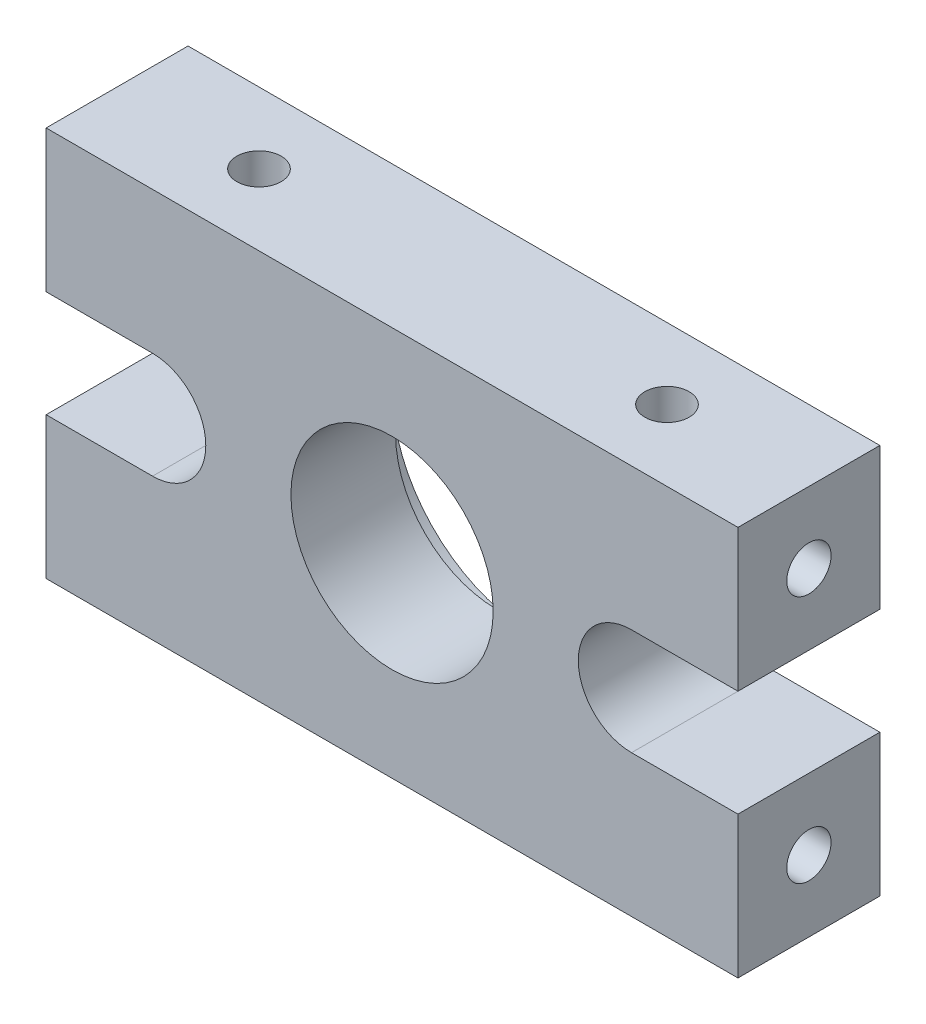
ISO-10303-21;
HEADER;
FILE_DESCRIPTION(('STEP AP214'),'2;1');
FILE_NAME('part.step','',(''),(''),'','','');
FILE_SCHEMA(('AUTOMOTIVE_DESIGN { 1 0 10303 214 1 1 1 1 }'));
ENDSEC;
DATA;
#1=APPLICATION_CONTEXT('core data for automotive mechanical design processes');
#2=APPLICATION_PROTOCOL_DEFINITION('international standard','automotive_design',2000,#1);
#3=PRODUCT_CONTEXT('',#1,'mechanical');
#4=PRODUCT('Part','Part','',(#3));
#5=PRODUCT_RELATED_PRODUCT_CATEGORY('part','',(#4));
#6=PRODUCT_DEFINITION_FORMATION('','',#4);
#7=PRODUCT_DEFINITION_CONTEXT('part definition',#1,'design');
#8=PRODUCT_DEFINITION('design','',#6,#7);
#9=PRODUCT_DEFINITION_SHAPE('','',#8);
#10=(LENGTH_UNIT() NAMED_UNIT(*) SI_UNIT(.MILLI.,.METRE.));
#11=(NAMED_UNIT(*) PLANE_ANGLE_UNIT() SI_UNIT($,.RADIAN.));
#12=(NAMED_UNIT(*) SI_UNIT($,.STERADIAN.) SOLID_ANGLE_UNIT());
#13=UNCERTAINTY_MEASURE_WITH_UNIT(LENGTH_MEASURE(1.E-05),#10,'distance_accuracy_value','');
#14=(GEOMETRIC_REPRESENTATION_CONTEXT(3) GLOBAL_UNCERTAINTY_ASSIGNED_CONTEXT((#13)) GLOBAL_UNIT_ASSIGNED_CONTEXT((#10,
#11,#12)) REPRESENTATION_CONTEXT('',''));
#15=CARTESIAN_POINT('',(0.,0.,0.));
#16=DIRECTION('',(0.,0.,1.));
#17=DIRECTION('',(1.,0.,0.));
#18=AXIS2_PLACEMENT_3D('',#15,#16,#17);
#19=CARTESIAN_POINT('',(19.5,11.,8.));
#20=DIRECTION('',(0.,0.,-1.));
#21=DIRECTION('',(-1.,0.,0.));
#22=AXIS2_PLACEMENT_3D('',#19,#20,#21);
#23=CYLINDRICAL_SURFACE('',#22,5.70000000000001);
#24=CARTESIAN_POINT('',(19.5,11.,8.));
#25=DIRECTION('',(0.,0.,1.));
#26=DIRECTION('',(1.,0.,0.));
#27=AXIS2_PLACEMENT_3D('',#24,#25,#26);
#28=CIRCLE('',#27,5.70000000000001);
#29=CARTESIAN_POINT('',(25.2,11.,8.));
#30=VERTEX_POINT('',#29);
#31=EDGE_CURVE('E165',#30,#30,#28,.T.);
#32=ORIENTED_EDGE('',*,*,#31,.T.);
#33=EDGE_LOOP('',(#32));
#34=FACE_BOUND('',#33,.T.);
#35=CARTESIAN_POINT('',(19.5,11.,2.1));
#36=DIRECTION('',(0.,0.,-1.));
#37=DIRECTION('',(-1.,0.,0.));
#38=AXIS2_PLACEMENT_3D('',#35,#36,#37);
#39=CIRCLE('',#38,5.70000000000001);
#40=CARTESIAN_POINT('',(13.8,11.,2.1));
#41=VERTEX_POINT('',#40);
#42=EDGE_CURVE('E39',#41,#41,#39,.T.);
#43=ORIENTED_EDGE('',*,*,#42,.T.);
#44=EDGE_LOOP('',(#43));
#45=FACE_BOUND('',#44,.T.);
#46=ADVANCED_FACE('F35',(#34,#45),#23,.F.);
#47=CARTESIAN_POINT('',(33.,11.,8.));
#48=DIRECTION('',(0.,0.,-1.));
#49=DIRECTION('',(-1.,0.,0.));
#50=AXIS2_PLACEMENT_3D('',#47,#48,#49);
#51=PLANE('',#50);
#52=DIRECTION('',(0.,-1.,0.));
#53=VECTOR('',#52,1.);
#54=CARTESIAN_POINT('',(0.,8.,8.));
#55=LINE('',#54,#53);
#56=CARTESIAN_POINT('',(0.,8.,8.));
#57=VERTEX_POINT('',#56);
#58=CARTESIAN_POINT('',(0.,0.,8.));
#59=VERTEX_POINT('',#58);
#60=EDGE_CURVE('E184',#57,#59,#55,.T.);
#61=ORIENTED_EDGE('',*,*,#60,.T.);
#62=DIRECTION('',(1.,0.,0.));
#63=VECTOR('',#62,1.);
#64=CARTESIAN_POINT('',(0.,0.,8.));
#65=LINE('',#64,#63);
#66=CARTESIAN_POINT('',(39.,0.,8.));
#67=VERTEX_POINT('',#66);
#68=EDGE_CURVE('E109',#59,#67,#65,.T.);
#69=ORIENTED_EDGE('',*,*,#68,.T.);
#70=DIRECTION('',(0.,1.,0.));
#71=VECTOR('',#70,1.);
#72=CARTESIAN_POINT('',(39.,0.,8.));
#73=LINE('',#72,#71);
#74=CARTESIAN_POINT('',(39.,8.,8.));
#75=VERTEX_POINT('',#74);
#76=EDGE_CURVE('E212',#67,#75,#73,.T.);
#77=ORIENTED_EDGE('',*,*,#76,.T.);
#78=DIRECTION('',(-1.,0.,0.));
#79=VECTOR('',#78,1.);
#80=CARTESIAN_POINT('',(39.,8.,8.));
#81=LINE('',#80,#79);
#82=CARTESIAN_POINT('',(33.,8.,8.));
#83=VERTEX_POINT('',#82);
#84=EDGE_CURVE('E230',#75,#83,#81,.T.);
#85=ORIENTED_EDGE('',*,*,#84,.T.);
#86=CARTESIAN_POINT('',(33.,11.,8.));
#87=DIRECTION('',(0.,0.,-1.));
#88=DIRECTION('',(-1.,0.,0.));
#89=AXIS2_PLACEMENT_3D('',#86,#87,#88);
#90=CIRCLE('',#89,3.);
#91=CARTESIAN_POINT('',(33.,14.,8.));
#92=VERTEX_POINT('',#91);
#93=EDGE_CURVE('E227',#83,#92,#90,.T.);
#94=ORIENTED_EDGE('',*,*,#93,.T.);
#95=DIRECTION('',(1.,0.,0.));
#96=VECTOR('',#95,1.);
#97=CARTESIAN_POINT('',(33.,14.,8.));
#98=LINE('',#97,#96);
#99=CARTESIAN_POINT('',(39.,14.,8.));
#100=VERTEX_POINT('',#99);
#101=EDGE_CURVE('E229',#92,#100,#98,.T.);
#102=ORIENTED_EDGE('',*,*,#101,.T.);
#103=DIRECTION('',(0.,1.,0.));
#104=VECTOR('',#103,1.);
#105=CARTESIAN_POINT('',(39.,14.,8.));
#106=LINE('',#105,#104);
#107=CARTESIAN_POINT('',(39.,22.,8.));
#108=VERTEX_POINT('',#107);
#109=EDGE_CURVE('E232',#100,#108,#106,.T.);
#110=ORIENTED_EDGE('',*,*,#109,.T.);
#111=DIRECTION('',(-1.,0.,0.));
#112=VECTOR('',#111,1.);
#113=CARTESIAN_POINT('',(39.,22.,8.));
#114=LINE('',#113,#112);
#115=CARTESIAN_POINT('',(0.,22.,8.));
#116=VERTEX_POINT('',#115);
#117=EDGE_CURVE('E238',#108,#116,#114,.T.);
#118=ORIENTED_EDGE('',*,*,#117,.T.);
#119=DIRECTION('',(0.,-1.,0.));
#120=VECTOR('',#119,1.);
#121=CARTESIAN_POINT('',(0.,14.,8.));
#122=LINE('',#121,#120);
#123=CARTESIAN_POINT('',(0.,14.,8.));
#124=VERTEX_POINT('',#123);
#125=EDGE_CURVE('E143',#116,#124,#122,.T.);
#126=ORIENTED_EDGE('',*,*,#125,.T.);
#127=DIRECTION('',(1.,0.,0.));
#128=VECTOR('',#127,1.);
#129=CARTESIAN_POINT('',(6.,14.,8.));
#130=LINE('',#129,#128);
#131=CARTESIAN_POINT('',(6.,14.,8.));
#132=VERTEX_POINT('',#131);
#133=EDGE_CURVE('E136',#124,#132,#130,.T.);
#134=ORIENTED_EDGE('',*,*,#133,.T.);
#135=CARTESIAN_POINT('',(6.,11.,8.));
#136=DIRECTION('',(0.,0.,-1.));
#137=DIRECTION('',(1.,0.,0.));
#138=AXIS2_PLACEMENT_3D('',#135,#136,#137);
#139=CIRCLE('',#138,3.);
#140=CARTESIAN_POINT('',(6.,8.,8.));
#141=VERTEX_POINT('',#140);
#142=EDGE_CURVE('E141',#132,#141,#139,.T.);
#143=ORIENTED_EDGE('',*,*,#142,.T.);
#144=DIRECTION('',(-1.,0.,0.));
#145=VECTOR('',#144,1.);
#146=CARTESIAN_POINT('',(0.,8.,8.));
#147=LINE('',#146,#145);
#148=EDGE_CURVE('E53',#141,#57,#147,.T.);
#149=ORIENTED_EDGE('',*,*,#148,.T.);
#150=EDGE_LOOP('',(#61,#69,#77,#85,#94,#102,#110,#118,#126,#134,#143,#149));
#151=FACE_BOUND('',#150,.T.);
#152=ORIENTED_EDGE('',*,*,#31,.F.);
#153=EDGE_LOOP('',(#152));
#154=FACE_BOUND('',#153,.T.);
#155=ADVANCED_FACE('F138',(#151,#154),#51,.F.);
#156=CARTESIAN_POINT('',(33.,11.,0.));
#157=DIRECTION('',(0.,0.,-1.));
#158=DIRECTION('',(-1.,0.,0.));
#159=AXIS2_PLACEMENT_3D('',#156,#157,#158);
#160=PLANE('',#159);
#161=CARTESIAN_POINT('',(19.5,11.,0.));
#162=DIRECTION('',(0.,0.,-1.));
#163=DIRECTION('',(-1.,0.,0.));
#164=AXIS2_PLACEMENT_3D('',#161,#162,#163);
#165=CIRCLE('',#164,8.);
#166=CARTESIAN_POINT('',(11.5,11.,0.));
#167=VERTEX_POINT('',#166);
#168=EDGE_CURVE('E284',#167,#167,#165,.T.);
#169=ORIENTED_EDGE('',*,*,#168,.F.);
#170=EDGE_LOOP('',(#169));
#171=FACE_BOUND('',#170,.T.);
#172=DIRECTION('',(0.,-1.,0.));
#173=VECTOR('',#172,1.);
#174=CARTESIAN_POINT('',(0.,8.,0.));
#175=LINE('',#174,#173);
#176=CARTESIAN_POINT('',(0.,8.,0.));
#177=VERTEX_POINT('',#176);
#178=CARTESIAN_POINT('',(0.,0.,0.));
#179=VERTEX_POINT('',#178);
#180=EDGE_CURVE('E161',#177,#179,#175,.T.);
#181=ORIENTED_EDGE('',*,*,#180,.F.);
#182=DIRECTION('',(-1.,0.,0.));
#183=VECTOR('',#182,1.);
#184=CARTESIAN_POINT('',(0.,8.,0.));
#185=LINE('',#184,#183);
#186=CARTESIAN_POINT('',(6.,8.,0.));
#187=VERTEX_POINT('',#186);
#188=EDGE_CURVE('E101',#187,#177,#185,.T.);
#189=ORIENTED_EDGE('',*,*,#188,.F.);
#190=CARTESIAN_POINT('',(6.,11.,0.));
#191=DIRECTION('',(0.,0.,-1.));
#192=DIRECTION('',(1.,0.,0.));
#193=AXIS2_PLACEMENT_3D('',#190,#191,#192);
#194=CIRCLE('',#193,3.);
#195=CARTESIAN_POINT('',(6.,14.,0.));
#196=VERTEX_POINT('',#195);
#197=EDGE_CURVE('E95',#196,#187,#194,.T.);
#198=ORIENTED_EDGE('',*,*,#197,.F.);
#199=DIRECTION('',(1.,0.,0.));
#200=VECTOR('',#199,1.);
#201=CARTESIAN_POINT('',(6.,14.,0.));
#202=LINE('',#201,#200);
#203=CARTESIAN_POINT('',(0.,14.,0.));
#204=VERTEX_POINT('',#203);
#205=EDGE_CURVE('E151',#204,#196,#202,.T.);
#206=ORIENTED_EDGE('',*,*,#205,.F.);
#207=DIRECTION('',(0.,-1.,0.));
#208=VECTOR('',#207,1.);
#209=CARTESIAN_POINT('',(0.,14.,0.));
#210=LINE('',#209,#208);
#211=CARTESIAN_POINT('',(0.,22.,0.));
#212=VERTEX_POINT('',#211);
#213=EDGE_CURVE('E179',#212,#204,#210,.T.);
#214=ORIENTED_EDGE('',*,*,#213,.F.);
#215=DIRECTION('',(-1.,0.,0.));
#216=VECTOR('',#215,1.);
#217=CARTESIAN_POINT('',(39.,22.,0.));
#218=LINE('',#217,#216);
#219=CARTESIAN_POINT('',(39.,22.,0.));
#220=VERTEX_POINT('',#219);
#221=EDGE_CURVE('E177',#220,#212,#218,.T.);
#222=ORIENTED_EDGE('',*,*,#221,.F.);
#223=DIRECTION('',(0.,1.,0.));
#224=VECTOR('',#223,1.);
#225=CARTESIAN_POINT('',(39.,14.,0.));
#226=LINE('',#225,#224);
#227=CARTESIAN_POINT('',(39.,14.,0.));
#228=VERTEX_POINT('',#227);
#229=EDGE_CURVE('E175',#228,#220,#226,.T.);
#230=ORIENTED_EDGE('',*,*,#229,.F.);
#231=DIRECTION('',(1.,0.,0.));
#232=VECTOR('',#231,1.);
#233=CARTESIAN_POINT('',(33.,14.,0.));
#234=LINE('',#233,#232);
#235=CARTESIAN_POINT('',(33.,14.,0.));
#236=VERTEX_POINT('',#235);
#237=EDGE_CURVE('E173',#236,#228,#234,.T.);
#238=ORIENTED_EDGE('',*,*,#237,.F.);
#239=CARTESIAN_POINT('',(33.,11.,0.));
#240=DIRECTION('',(0.,0.,-1.));
#241=DIRECTION('',(-1.,0.,0.));
#242=AXIS2_PLACEMENT_3D('',#239,#240,#241);
#243=CIRCLE('',#242,3.);
#244=CARTESIAN_POINT('',(33.,8.,0.));
#245=VERTEX_POINT('',#244);
#246=EDGE_CURVE('E171',#245,#236,#243,.T.);
#247=ORIENTED_EDGE('',*,*,#246,.F.);
#248=DIRECTION('',(-1.,0.,0.));
#249=VECTOR('',#248,1.);
#250=CARTESIAN_POINT('',(39.,8.,0.));
#251=LINE('',#250,#249);
#252=CARTESIAN_POINT('',(39.,8.,0.));
#253=VERTEX_POINT('',#252);
#254=EDGE_CURVE('E169',#253,#245,#251,.T.);
#255=ORIENTED_EDGE('',*,*,#254,.F.);
#256=DIRECTION('',(0.,1.,0.));
#257=VECTOR('',#256,1.);
#258=CARTESIAN_POINT('',(39.,0.,0.));
#259=LINE('',#258,#257);
#260=CARTESIAN_POINT('',(39.,0.,0.));
#261=VERTEX_POINT('',#260);
#262=EDGE_CURVE('E167',#261,#253,#259,.T.);
#263=ORIENTED_EDGE('',*,*,#262,.F.);
#264=DIRECTION('',(1.,0.,0.));
#265=VECTOR('',#264,1.);
#266=CARTESIAN_POINT('',(0.,0.,0.));
#267=LINE('',#266,#265);
#268=EDGE_CURVE('E164',#179,#261,#267,.T.);
#269=ORIENTED_EDGE('',*,*,#268,.F.);
#270=EDGE_LOOP('',(#181,#189,#198,#206,#214,#222,#230,#238,#247,#255,#263,#269));
#271=FACE_BOUND('',#270,.T.);
#272=ADVANCED_FACE('F216',(#171,#271),#160,.T.);
#273=CARTESIAN_POINT('',(0.,8.,8.));
#274=DIRECTION('',(1.,0.,0.));
#275=DIRECTION('',(0.,0.,-1.));
#276=AXIS2_PLACEMENT_3D('',#273,#274,#275);
#277=PLANE('',#276);
#278=CARTESIAN_POINT('',(0.,4.,4.));
#279=DIRECTION('',(-1.,0.,0.));
#280=DIRECTION('',(0.,0.,1.));
#281=AXIS2_PLACEMENT_3D('',#278,#279,#280);
#282=CIRCLE('',#281,1.24999999999999);
#283=CARTESIAN_POINT('',(0.,4.,5.24999999999999));
#284=VERTEX_POINT('',#283);
#285=EDGE_CURVE('E303',#284,#284,#282,.T.);
#286=ORIENTED_EDGE('',*,*,#285,.F.);
#287=EDGE_LOOP('',(#286));
#288=FACE_BOUND('',#287,.T.);
#289=ORIENTED_EDGE('',*,*,#180,.T.);
#290=DIRECTION('',(0.,0.,-1.));
#291=VECTOR('',#290,1.);
#292=CARTESIAN_POINT('',(0.,0.,8.));
#293=LINE('',#292,#291);
#294=EDGE_CURVE('E11',#59,#179,#293,.T.);
#295=ORIENTED_EDGE('',*,*,#294,.F.);
#296=ORIENTED_EDGE('',*,*,#60,.F.);
#297=DIRECTION('',(0.,0.,-1.));
#298=VECTOR('',#297,1.);
#299=CARTESIAN_POINT('',(0.,8.,8.));
#300=LINE('',#299,#298);
#301=EDGE_CURVE('E157',#57,#177,#300,.T.);
#302=ORIENTED_EDGE('',*,*,#301,.T.);
#303=EDGE_LOOP('',(#289,#295,#296,#302));
#304=FACE_BOUND('',#303,.T.);
#305=ADVANCED_FACE('F37',(#288,#304),#277,.F.);
#306=CARTESIAN_POINT('',(0.,0.,8.));
#307=DIRECTION('',(0.,1.,0.));
#308=DIRECTION('',(0.,0.,1.));
#309=AXIS2_PLACEMENT_3D('',#306,#307,#308);
#310=PLANE('',#309);
#311=ORIENTED_EDGE('',*,*,#268,.T.);
#312=DIRECTION('',(0.,0.,-1.));
#313=VECTOR('',#312,1.);
#314=CARTESIAN_POINT('',(39.,0.,8.));
#315=LINE('',#314,#313);
#316=EDGE_CURVE('E45',#67,#261,#315,.T.);
#317=ORIENTED_EDGE('',*,*,#316,.F.);
#318=ORIENTED_EDGE('',*,*,#68,.F.);
#319=ORIENTED_EDGE('',*,*,#294,.T.);
#320=EDGE_LOOP('',(#311,#317,#318,#319));
#321=FACE_BOUND('',#320,.T.);
#322=ADVANCED_FACE('F280',(#321),#310,.F.);
#323=CARTESIAN_POINT('',(39.,0.,8.));
#324=DIRECTION('',(-1.,0.,0.));
#325=DIRECTION('',(0.,0.,1.));
#326=AXIS2_PLACEMENT_3D('',#323,#324,#325);
#327=PLANE('',#326);
#328=CARTESIAN_POINT('',(39.,4.,4.));
#329=DIRECTION('',(1.,0.,0.));
#330=DIRECTION('',(0.,0.,-1.));
#331=AXIS2_PLACEMENT_3D('',#328,#329,#330);
#332=CIRCLE('',#331,1.24999999999999);
#333=CARTESIAN_POINT('',(39.,4.,2.75000000000001));
#334=VERTEX_POINT('',#333);
#335=EDGE_CURVE('E321',#334,#334,#332,.T.);
#336=ORIENTED_EDGE('',*,*,#335,.F.);
#337=EDGE_LOOP('',(#336));
#338=FACE_BOUND('',#337,.T.);
#339=ORIENTED_EDGE('',*,*,#262,.T.);
#340=DIRECTION('',(0.,0.,-1.));
#341=VECTOR('',#340,1.);
#342=CARTESIAN_POINT('',(39.,8.,8.));
#343=LINE('',#342,#341);
#344=EDGE_CURVE('E203',#75,#253,#343,.T.);
#345=ORIENTED_EDGE('',*,*,#344,.F.);
#346=ORIENTED_EDGE('',*,*,#76,.F.);
#347=ORIENTED_EDGE('',*,*,#316,.T.);
#348=EDGE_LOOP('',(#339,#345,#346,#347));
#349=FACE_BOUND('',#348,.T.);
#350=ADVANCED_FACE('F210',(#338,#349),#327,.F.);
#351=CARTESIAN_POINT('',(39.,8.,8.));
#352=DIRECTION('',(0.,-1.,0.));
#353=DIRECTION('',(1.,0.,0.));
#354=AXIS2_PLACEMENT_3D('',#351,#352,#353);
#355=PLANE('',#354);
#356=ORIENTED_EDGE('',*,*,#254,.T.);
#357=DIRECTION('',(0.,0.,-1.));
#358=VECTOR('',#357,1.);
#359=CARTESIAN_POINT('',(33.,8.,8.));
#360=LINE('',#359,#358);
#361=EDGE_CURVE('E200',#83,#245,#360,.T.);
#362=ORIENTED_EDGE('',*,*,#361,.F.);
#363=ORIENTED_EDGE('',*,*,#84,.F.);
#364=ORIENTED_EDGE('',*,*,#344,.T.);
#365=EDGE_LOOP('',(#356,#362,#363,#364));
#366=FACE_BOUND('',#365,.T.);
#367=ADVANCED_FACE('F221',(#366),#355,.F.);
#368=CARTESIAN_POINT('',(33.,11.,8.));
#369=DIRECTION('',(0.,0.,-1.));
#370=DIRECTION('',(-1.,0.,0.));
#371=AXIS2_PLACEMENT_3D('',#368,#369,#370);
#372=CYLINDRICAL_SURFACE('',#371,3.);
#373=ORIENTED_EDGE('',*,*,#246,.T.);
#374=DIRECTION('',(0.,0.,-1.));
#375=VECTOR('',#374,1.);
#376=CARTESIAN_POINT('',(33.,14.,8.));
#377=LINE('',#376,#375);
#378=EDGE_CURVE('E197',#92,#236,#377,.T.);
#379=ORIENTED_EDGE('',*,*,#378,.F.);
#380=ORIENTED_EDGE('',*,*,#93,.F.);
#381=ORIENTED_EDGE('',*,*,#361,.T.);
#382=EDGE_LOOP('',(#373,#379,#380,#381));
#383=FACE_BOUND('',#382,.T.);
#384=ADVANCED_FACE('F225',(#383),#372,.F.);
#385=CARTESIAN_POINT('',(33.,14.,8.));
#386=DIRECTION('',(0.,1.,0.));
#387=DIRECTION('',(0.,0.,1.));
#388=AXIS2_PLACEMENT_3D('',#385,#386,#387);
#389=PLANE('',#388);
#390=ORIENTED_EDGE('',*,*,#237,.T.);
#391=DIRECTION('',(0.,0.,-1.));
#392=VECTOR('',#391,1.);
#393=CARTESIAN_POINT('',(39.,14.,8.));
#394=LINE('',#393,#392);
#395=EDGE_CURVE('E194',#100,#228,#394,.T.);
#396=ORIENTED_EDGE('',*,*,#395,.F.);
#397=ORIENTED_EDGE('',*,*,#101,.F.);
#398=ORIENTED_EDGE('',*,*,#378,.T.);
#399=EDGE_LOOP('',(#390,#396,#397,#398));
#400=FACE_BOUND('',#399,.T.);
#401=ADVANCED_FACE('F348',(#400),#389,.F.);
#402=CARTESIAN_POINT('',(39.,14.,8.));
#403=DIRECTION('',(-1.,0.,0.));
#404=DIRECTION('',(0.,0.,1.));
#405=AXIS2_PLACEMENT_3D('',#402,#403,#404);
#406=PLANE('',#405);
#407=CARTESIAN_POINT('',(39.,18.,4.));
#408=DIRECTION('',(1.,0.,0.));
#409=DIRECTION('',(0.,0.,-1.));
#410=AXIS2_PLACEMENT_3D('',#407,#408,#409);
#411=CIRCLE('',#410,1.24999999999999);
#412=CARTESIAN_POINT('',(39.,18.,2.75000000000001));
#413=VERTEX_POINT('',#412);
#414=EDGE_CURVE('E315',#413,#413,#411,.T.);
#415=ORIENTED_EDGE('',*,*,#414,.F.);
#416=EDGE_LOOP('',(#415));
#417=FACE_BOUND('',#416,.T.);
#418=ORIENTED_EDGE('',*,*,#229,.T.);
#419=DIRECTION('',(0.,0.,-1.));
#420=VECTOR('',#419,1.);
#421=CARTESIAN_POINT('',(39.,22.,8.));
#422=LINE('',#421,#420);
#423=EDGE_CURVE('E191',#108,#220,#422,.T.);
#424=ORIENTED_EDGE('',*,*,#423,.F.);
#425=ORIENTED_EDGE('',*,*,#109,.F.);
#426=ORIENTED_EDGE('',*,*,#395,.T.);
#427=EDGE_LOOP('',(#418,#424,#425,#426));
#428=FACE_BOUND('',#427,.T.);
#429=ADVANCED_FACE('F351',(#417,#428),#406,.F.);
#430=CARTESIAN_POINT('',(39.,22.,8.));
#431=DIRECTION('',(0.,-1.,0.));
#432=DIRECTION('',(1.,0.,0.));
#433=AXIS2_PLACEMENT_3D('',#430,#431,#432);
#434=PLANE('',#433);
#435=CARTESIAN_POINT('',(31.,22.,4.));
#436=DIRECTION('',(0.,1.,0.));
#437=DIRECTION('',(0.,0.,1.));
#438=AXIS2_PLACEMENT_3D('',#435,#436,#437);
#439=CIRCLE('',#438,1.24999999999999);
#440=CARTESIAN_POINT('',(31.,22.,5.24999999999999));
#441=VERTEX_POINT('',#440);
#442=EDGE_CURVE('E291',#441,#441,#439,.T.);
#443=ORIENTED_EDGE('',*,*,#442,.F.);
#444=EDGE_LOOP('',(#443));
#445=FACE_BOUND('',#444,.T.);
#446=CARTESIAN_POINT('',(8.,22.,4.));
#447=DIRECTION('',(0.,1.,0.));
#448=DIRECTION('',(0.,0.,1.));
#449=AXIS2_PLACEMENT_3D('',#446,#447,#448);
#450=CIRCLE('',#449,1.24999999999999);
#451=CARTESIAN_POINT('',(8.,22.,5.24999999999999));
#452=VERTEX_POINT('',#451);
#453=EDGE_CURVE('E297',#452,#452,#450,.T.);
#454=ORIENTED_EDGE('',*,*,#453,.F.);
#455=EDGE_LOOP('',(#454));
#456=FACE_BOUND('',#455,.T.);
#457=ORIENTED_EDGE('',*,*,#221,.T.);
#458=DIRECTION('',(0.,0.,-1.));
#459=VECTOR('',#458,1.);
#460=CARTESIAN_POINT('',(0.,22.,8.));
#461=LINE('',#460,#459);
#462=EDGE_CURVE('E188',#116,#212,#461,.T.);
#463=ORIENTED_EDGE('',*,*,#462,.F.);
#464=ORIENTED_EDGE('',*,*,#117,.F.);
#465=ORIENTED_EDGE('',*,*,#423,.T.);
#466=EDGE_LOOP('',(#457,#463,#464,#465));
#467=FACE_BOUND('',#466,.T.);
#468=ADVANCED_FACE('F244',(#445,#456,#467),#434,.F.);
#469=CARTESIAN_POINT('',(0.,14.,8.));
#470=DIRECTION('',(1.,0.,0.));
#471=DIRECTION('',(0.,0.,-1.));
#472=AXIS2_PLACEMENT_3D('',#469,#470,#471);
#473=PLANE('',#472);
#474=CARTESIAN_POINT('',(0.,18.,4.));
#475=DIRECTION('',(-1.,0.,0.));
#476=DIRECTION('',(0.,0.,1.));
#477=AXIS2_PLACEMENT_3D('',#474,#475,#476);
#478=CIRCLE('',#477,1.24999999999999);
#479=CARTESIAN_POINT('',(0.,18.,5.24999999999999));
#480=VERTEX_POINT('',#479);
#481=EDGE_CURVE('E309',#480,#480,#478,.T.);
#482=ORIENTED_EDGE('',*,*,#481,.F.);
#483=EDGE_LOOP('',(#482));
#484=FACE_BOUND('',#483,.T.);
#485=ORIENTED_EDGE('',*,*,#213,.T.);
#486=DIRECTION('',(0.,0.,-1.));
#487=VECTOR('',#486,1.);
#488=CARTESIAN_POINT('',(0.,14.,8.));
#489=LINE('',#488,#487);
#490=EDGE_CURVE('E152',#124,#204,#489,.T.);
#491=ORIENTED_EDGE('',*,*,#490,.F.);
#492=ORIENTED_EDGE('',*,*,#125,.F.);
#493=ORIENTED_EDGE('',*,*,#462,.T.);
#494=EDGE_LOOP('',(#485,#491,#492,#493));
#495=FACE_BOUND('',#494,.T.);
#496=ADVANCED_FACE('F248',(#484,#495),#473,.F.);
#497=CARTESIAN_POINT('',(6.,14.,8.));
#498=DIRECTION('',(0.,1.,0.));
#499=DIRECTION('',(-1.,0.,0.));
#500=AXIS2_PLACEMENT_3D('',#497,#498,#499);
#501=PLANE('',#500);
#502=ORIENTED_EDGE('',*,*,#205,.T.);
#503=DIRECTION('',(0.,0.,-1.));
#504=VECTOR('',#503,1.);
#505=CARTESIAN_POINT('',(6.,14.,8.));
#506=LINE('',#505,#504);
#507=EDGE_CURVE('E148',#132,#196,#506,.T.);
#508=ORIENTED_EDGE('',*,*,#507,.F.);
#509=ORIENTED_EDGE('',*,*,#133,.F.);
#510=ORIENTED_EDGE('',*,*,#490,.T.);
#511=EDGE_LOOP('',(#502,#508,#509,#510));
#512=FACE_BOUND('',#511,.T.);
#513=ADVANCED_FACE('F149',(#512),#501,.F.);
#514=CARTESIAN_POINT('',(6.,11.,8.));
#515=DIRECTION('',(0.,0.,-1.));
#516=DIRECTION('',(-1.,0.,0.));
#517=AXIS2_PLACEMENT_3D('',#514,#515,#516);
#518=CYLINDRICAL_SURFACE('',#517,3.);
#519=ORIENTED_EDGE('',*,*,#197,.T.);
#520=DIRECTION('',(0.,0.,-1.));
#521=VECTOR('',#520,1.);
#522=CARTESIAN_POINT('',(6.,8.,8.));
#523=LINE('',#522,#521);
#524=EDGE_CURVE('E153',#141,#187,#523,.T.);
#525=ORIENTED_EDGE('',*,*,#524,.F.);
#526=ORIENTED_EDGE('',*,*,#142,.F.);
#527=ORIENTED_EDGE('',*,*,#507,.T.);
#528=EDGE_LOOP('',(#519,#525,#526,#527));
#529=FACE_BOUND('',#528,.T.);
#530=ADVANCED_FACE('F155',(#529),#518,.F.);
#531=CARTESIAN_POINT('',(0.,8.,8.));
#532=DIRECTION('',(0.,-1.,0.));
#533=DIRECTION('',(0.,0.,-1.));
#534=AXIS2_PLACEMENT_3D('',#531,#532,#533);
#535=PLANE('',#534);
#536=ORIENTED_EDGE('',*,*,#188,.T.);
#537=ORIENTED_EDGE('',*,*,#301,.F.);
#538=ORIENTED_EDGE('',*,*,#148,.F.);
#539=ORIENTED_EDGE('',*,*,#524,.T.);
#540=EDGE_LOOP('',(#536,#537,#538,#539));
#541=FACE_BOUND('',#540,.T.);
#542=ADVANCED_FACE('F252',(#541),#535,.F.);
#543=CARTESIAN_POINT('',(34.,4.,4.));
#544=DIRECTION('',(1.,0.,0.));
#545=DIRECTION('',(0.,0.,-1.));
#546=AXIS2_PLACEMENT_3D('',#543,#544,#545);
#547=CONICAL_SURFACE('',#546,1.24999999999999,1.02974425867665);
#548=CARTESIAN_POINT('',(33.2489242262155,4.,4.));
#549=VERTEX_POINT('',#548);
#550=VERTEX_LOOP('',#549);
#551=FACE_BOUND('',#550,.T.);
#552=CARTESIAN_POINT('',(34.,4.,4.));
#553=DIRECTION('',(1.,0.,0.));
#554=DIRECTION('',(0.,0.,-1.));
#555=AXIS2_PLACEMENT_3D('',#552,#553,#554);
#556=CIRCLE('',#555,1.24999999999999);
#557=CARTESIAN_POINT('',(34.,4.,2.75000000000001));
#558=VERTEX_POINT('',#557);
#559=EDGE_CURVE('E324',#558,#558,#556,.T.);
#560=ORIENTED_EDGE('',*,*,#559,.T.);
#561=EDGE_LOOP('',(#560));
#562=FACE_BOUND('',#561,.T.);
#563=ADVANCED_FACE('F254',(#551,#562),#547,.F.);
#564=CARTESIAN_POINT('',(39.,4.,4.));
#565=DIRECTION('',(1.,0.,0.));
#566=DIRECTION('',(0.,0.,-1.));
#567=AXIS2_PLACEMENT_3D('',#564,#565,#566);
#568=CYLINDRICAL_SURFACE('',#567,1.24999999999999);
#569=ORIENTED_EDGE('',*,*,#559,.F.);
#570=EDGE_LOOP('',(#569));
#571=FACE_BOUND('',#570,.T.);
#572=ORIENTED_EDGE('',*,*,#335,.T.);
#573=EDGE_LOOP('',(#572));
#574=FACE_BOUND('',#573,.T.);
#575=ADVANCED_FACE('F260',(#571,#574),#568,.F.);
#576=CARTESIAN_POINT('',(34.,18.,4.));
#577=DIRECTION('',(1.,0.,0.));
#578=DIRECTION('',(0.,0.,-1.));
#579=AXIS2_PLACEMENT_3D('',#576,#577,#578);
#580=CONICAL_SURFACE('',#579,1.24999999999999,1.02974425867665);
#581=CARTESIAN_POINT('',(33.2489242262155,18.,4.));
#582=VERTEX_POINT('',#581);
#583=VERTEX_LOOP('',#582);
#584=FACE_BOUND('',#583,.T.);
#585=CARTESIAN_POINT('',(34.,18.,4.));
#586=DIRECTION('',(1.,0.,0.));
#587=DIRECTION('',(0.,0.,-1.));
#588=AXIS2_PLACEMENT_3D('',#585,#586,#587);
#589=CIRCLE('',#588,1.24999999999999);
#590=CARTESIAN_POINT('',(34.,18.,2.75000000000001));
#591=VERTEX_POINT('',#590);
#592=EDGE_CURVE('E318',#591,#591,#589,.T.);
#593=ORIENTED_EDGE('',*,*,#592,.T.);
#594=EDGE_LOOP('',(#593));
#595=FACE_BOUND('',#594,.T.);
#596=ADVANCED_FACE('F335',(#584,#595),#580,.F.);
#597=CARTESIAN_POINT('',(39.,18.,4.));
#598=DIRECTION('',(1.,0.,0.));
#599=DIRECTION('',(0.,0.,-1.));
#600=AXIS2_PLACEMENT_3D('',#597,#598,#599);
#601=CYLINDRICAL_SURFACE('',#600,1.24999999999999);
#602=ORIENTED_EDGE('',*,*,#592,.F.);
#603=EDGE_LOOP('',(#602));
#604=FACE_BOUND('',#603,.T.);
#605=ORIENTED_EDGE('',*,*,#414,.T.);
#606=EDGE_LOOP('',(#605));
#607=FACE_BOUND('',#606,.T.);
#608=ADVANCED_FACE('F411',(#604,#607),#601,.F.);
#609=CARTESIAN_POINT('',(5.,18.,4.));
#610=DIRECTION('',(-1.,0.,0.));
#611=DIRECTION('',(0.,0.,1.));
#612=AXIS2_PLACEMENT_3D('',#609,#610,#611);
#613=CONICAL_SURFACE('',#612,1.24999999999999,1.02974425867665);
#614=CARTESIAN_POINT('',(5.75107577378445,18.,4.));
#615=VERTEX_POINT('',#614);
#616=VERTEX_LOOP('',#615);
#617=FACE_BOUND('',#616,.T.);
#618=CARTESIAN_POINT('',(5.,18.,4.));
#619=DIRECTION('',(-1.,0.,0.));
#620=DIRECTION('',(0.,0.,1.));
#621=AXIS2_PLACEMENT_3D('',#618,#619,#620);
#622=CIRCLE('',#621,1.24999999999999);
#623=CARTESIAN_POINT('',(5.,18.,5.24999999999999));
#624=VERTEX_POINT('',#623);
#625=EDGE_CURVE('E312',#624,#624,#622,.T.);
#626=ORIENTED_EDGE('',*,*,#625,.T.);
#627=EDGE_LOOP('',(#626));
#628=FACE_BOUND('',#627,.T.);
#629=ADVANCED_FACE('F421',(#617,#628),#613,.F.);
#630=CARTESIAN_POINT('',(0.,18.,4.));
#631=DIRECTION('',(-1.,0.,0.));
#632=DIRECTION('',(0.,0.,1.));
#633=AXIS2_PLACEMENT_3D('',#630,#631,#632);
#634=CYLINDRICAL_SURFACE('',#633,1.24999999999999);
#635=ORIENTED_EDGE('',*,*,#625,.F.);
#636=EDGE_LOOP('',(#635));
#637=FACE_BOUND('',#636,.T.);
#638=ORIENTED_EDGE('',*,*,#481,.T.);
#639=EDGE_LOOP('',(#638));
#640=FACE_BOUND('',#639,.T.);
#641=ADVANCED_FACE('F442',(#637,#640),#634,.F.);
#642=CARTESIAN_POINT('',(5.,4.,4.));
#643=DIRECTION('',(-1.,0.,0.));
#644=DIRECTION('',(0.,0.,1.));
#645=AXIS2_PLACEMENT_3D('',#642,#643,#644);
#646=CONICAL_SURFACE('',#645,1.24999999999999,1.02974425867665);
#647=CARTESIAN_POINT('',(5.75107577378445,4.,4.));
#648=VERTEX_POINT('',#647);
#649=VERTEX_LOOP('',#648);
#650=FACE_BOUND('',#649,.T.);
#651=CARTESIAN_POINT('',(5.,4.,4.));
#652=DIRECTION('',(-1.,0.,0.));
#653=DIRECTION('',(0.,0.,1.));
#654=AXIS2_PLACEMENT_3D('',#651,#652,#653);
#655=CIRCLE('',#654,1.24999999999999);
#656=CARTESIAN_POINT('',(5.,4.,5.24999999999999));
#657=VERTEX_POINT('',#656);
#658=EDGE_CURVE('E306',#657,#657,#655,.T.);
#659=ORIENTED_EDGE('',*,*,#658,.T.);
#660=EDGE_LOOP('',(#659));
#661=FACE_BOUND('',#660,.T.);
#662=ADVANCED_FACE('F452',(#650,#661),#646,.F.);
#663=CARTESIAN_POINT('',(0.,4.,4.));
#664=DIRECTION('',(-1.,0.,0.));
#665=DIRECTION('',(0.,0.,1.));
#666=AXIS2_PLACEMENT_3D('',#663,#664,#665);
#667=CYLINDRICAL_SURFACE('',#666,1.24999999999999);
#668=ORIENTED_EDGE('',*,*,#658,.F.);
#669=EDGE_LOOP('',(#668));
#670=FACE_BOUND('',#669,.T.);
#671=ORIENTED_EDGE('',*,*,#285,.T.);
#672=EDGE_LOOP('',(#671));
#673=FACE_BOUND('',#672,.T.);
#674=ADVANCED_FACE('F462',(#670,#673),#667,.F.);
#675=CARTESIAN_POINT('',(8.,17.,4.));
#676=DIRECTION('',(0.,1.,0.));
#677=DIRECTION('',(0.,0.,1.));
#678=AXIS2_PLACEMENT_3D('',#675,#676,#677);
#679=CONICAL_SURFACE('',#678,1.24999999999999,1.02974425867665);
#680=CARTESIAN_POINT('',(7.99999999999999,16.2489242262155,4.));
#681=VERTEX_POINT('',#680);
#682=VERTEX_LOOP('',#681);
#683=FACE_BOUND('',#682,.T.);
#684=CARTESIAN_POINT('',(8.,17.,4.));
#685=DIRECTION('',(0.,1.,0.));
#686=DIRECTION('',(0.,0.,1.));
#687=AXIS2_PLACEMENT_3D('',#684,#685,#686);
#688=CIRCLE('',#687,1.24999999999999);
#689=CARTESIAN_POINT('',(8.,17.,5.24999999999999));
#690=VERTEX_POINT('',#689);
#691=EDGE_CURVE('E300',#690,#690,#688,.T.);
#692=ORIENTED_EDGE('',*,*,#691,.T.);
#693=EDGE_LOOP('',(#692));
#694=FACE_BOUND('',#693,.T.);
#695=ADVANCED_FACE('F472',(#683,#694),#679,.F.);
#696=CARTESIAN_POINT('',(8.,22.,4.));
#697=DIRECTION('',(0.,1.,0.));
#698=DIRECTION('',(0.,0.,1.));
#699=AXIS2_PLACEMENT_3D('',#696,#697,#698);
#700=CYLINDRICAL_SURFACE('',#699,1.24999999999999);
#701=ORIENTED_EDGE('',*,*,#691,.F.);
#702=EDGE_LOOP('',(#701));
#703=FACE_BOUND('',#702,.T.);
#704=ORIENTED_EDGE('',*,*,#453,.T.);
#705=EDGE_LOOP('',(#704));
#706=FACE_BOUND('',#705,.T.);
#707=ADVANCED_FACE('F487',(#703,#706),#700,.F.);
#708=CARTESIAN_POINT('',(31.,17.,4.));
#709=DIRECTION('',(0.,1.,0.));
#710=DIRECTION('',(0.,0.,1.));
#711=AXIS2_PLACEMENT_3D('',#708,#709,#710);
#712=CONICAL_SURFACE('',#711,1.24999999999999,1.02974425867665);
#713=CARTESIAN_POINT('',(31.,16.2489242262155,4.));
#714=VERTEX_POINT('',#713);
#715=VERTEX_LOOP('',#714);
#716=FACE_BOUND('',#715,.T.);
#717=CARTESIAN_POINT('',(31.,17.,4.));
#718=DIRECTION('',(0.,1.,0.));
#719=DIRECTION('',(0.,0.,1.));
#720=AXIS2_PLACEMENT_3D('',#717,#718,#719);
#721=CIRCLE('',#720,1.24999999999999);
#722=CARTESIAN_POINT('',(31.,17.,5.24999999999999));
#723=VERTEX_POINT('',#722);
#724=EDGE_CURVE('E294',#723,#723,#721,.T.);
#725=ORIENTED_EDGE('',*,*,#724,.T.);
#726=EDGE_LOOP('',(#725));
#727=FACE_BOUND('',#726,.T.);
#728=ADVANCED_FACE('F497',(#716,#727),#712,.F.);
#729=CARTESIAN_POINT('',(31.,22.,4.));
#730=DIRECTION('',(0.,1.,0.));
#731=DIRECTION('',(0.,0.,1.));
#732=AXIS2_PLACEMENT_3D('',#729,#730,#731);
#733=CYLINDRICAL_SURFACE('',#732,1.24999999999999);
#734=ORIENTED_EDGE('',*,*,#724,.F.);
#735=EDGE_LOOP('',(#734));
#736=FACE_BOUND('',#735,.T.);
#737=ORIENTED_EDGE('',*,*,#442,.T.);
#738=EDGE_LOOP('',(#737));
#739=FACE_BOUND('',#738,.T.);
#740=ADVANCED_FACE('F507',(#736,#739),#733,.F.);
#741=CARTESIAN_POINT('',(19.5,11.,2.1));
#742=DIRECTION('',(0.,0.,-1.));
#743=DIRECTION('',(-1.,0.,0.));
#744=AXIS2_PLACEMENT_3D('',#741,#742,#743);
#745=CYLINDRICAL_SURFACE('',#744,8.);
#746=CARTESIAN_POINT('',(19.5,11.,2.1));
#747=DIRECTION('',(0.,0.,-1.));
#748=DIRECTION('',(-1.,0.,0.));
#749=AXIS2_PLACEMENT_3D('',#746,#747,#748);
#750=CIRCLE('',#749,8.);
#751=CARTESIAN_POINT('',(11.5,11.,2.1));
#752=VERTEX_POINT('',#751);
#753=EDGE_CURVE('E286',#752,#752,#750,.T.);
#754=ORIENTED_EDGE('',*,*,#753,.F.);
#755=EDGE_LOOP('',(#754));
#756=FACE_BOUND('',#755,.T.);
#757=ORIENTED_EDGE('',*,*,#168,.T.);
#758=EDGE_LOOP('',(#757));
#759=FACE_BOUND('',#758,.T.);
#760=ADVANCED_FACE('F516',(#756,#759),#745,.F.);
#761=CARTESIAN_POINT('',(19.5,11.,2.1));
#762=DIRECTION('',(0.,0.,-1.));
#763=DIRECTION('',(-1.,0.,0.));
#764=AXIS2_PLACEMENT_3D('',#761,#762,#763);
#765=PLANE('',#764);
#766=ORIENTED_EDGE('',*,*,#42,.F.);
#767=EDGE_LOOP('',(#766));
#768=FACE_BOUND('',#767,.T.);
#769=ORIENTED_EDGE('',*,*,#753,.T.);
#770=EDGE_LOOP('',(#769));
#771=FACE_BOUND('',#770,.T.);
#772=ADVANCED_FACE('F535',(#768,#771),#765,.T.);
#773=CLOSED_SHELL('',(#46,#155,#272,#305,#322,#350,#367,#384,#401,#429,#468,#496,#513,#530,#542,
#563,#575,#596,#608,#629,#641,#662,#674,#695,#707,#728,#740,#760,#772));
#774=MANIFOLD_SOLID_BREP('B2',#773);
#775=ADVANCED_BREP_SHAPE_REPRESENTATION('',(#18,#774),#14);
#776=SHAPE_DEFINITION_REPRESENTATION(#9,#775);
ENDSEC;
END-ISO-10303-21;
